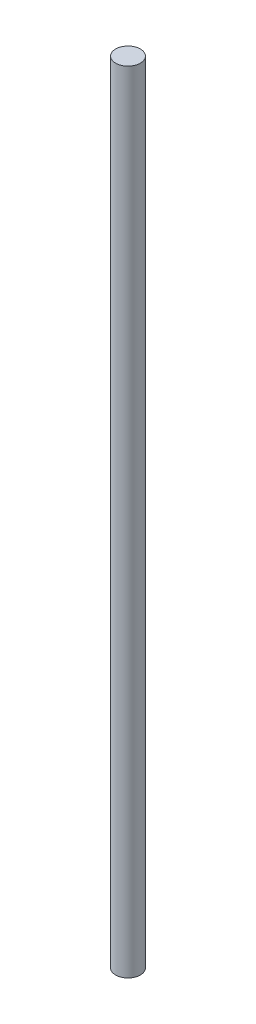
ISO-10303-21;
HEADER;
FILE_DESCRIPTION(('STEP AP214'),'2;1');
FILE_NAME('part.step','',(''),(''),'','','');
FILE_SCHEMA(('AUTOMOTIVE_DESIGN { 1 0 10303 214 1 1 1 1 }'));
ENDSEC;
DATA;
#1=APPLICATION_CONTEXT('core data for automotive mechanical design processes');
#2=APPLICATION_PROTOCOL_DEFINITION('international standard','automotive_design',2000,#1);
#3=PRODUCT_CONTEXT('',#1,'mechanical');
#4=PRODUCT('Part','Part','',(#3));
#5=PRODUCT_RELATED_PRODUCT_CATEGORY('part','',(#4));
#6=PRODUCT_DEFINITION_FORMATION('','',#4);
#7=PRODUCT_DEFINITION_CONTEXT('part definition',#1,'design');
#8=PRODUCT_DEFINITION('design','',#6,#7);
#9=PRODUCT_DEFINITION_SHAPE('','',#8);
#10=(LENGTH_UNIT() NAMED_UNIT(*) SI_UNIT(.MILLI.,.METRE.));
#11=(NAMED_UNIT(*) PLANE_ANGLE_UNIT() SI_UNIT($,.RADIAN.));
#12=(NAMED_UNIT(*) SI_UNIT($,.STERADIAN.) SOLID_ANGLE_UNIT());
#13=UNCERTAINTY_MEASURE_WITH_UNIT(LENGTH_MEASURE(1.E-05),#10,'distance_accuracy_value','');
#14=(GEOMETRIC_REPRESENTATION_CONTEXT(3) GLOBAL_UNCERTAINTY_ASSIGNED_CONTEXT((#13)) GLOBAL_UNIT_ASSIGNED_CONTEXT((#10,
#11,#12)) REPRESENTATION_CONTEXT('',''));
#15=CARTESIAN_POINT('',(0.,0.,0.));
#16=DIRECTION('',(0.,0.,1.));
#17=DIRECTION('',(1.,0.,0.));
#18=AXIS2_PLACEMENT_3D('',#15,#16,#17);
#19=CARTESIAN_POINT('',(0.,254.,0.));
#20=DIRECTION('',(0.,-1.,0.));
#21=DIRECTION('',(0.,0.,-1.));
#22=AXIS2_PLACEMENT_3D('',#19,#20,#21);
#23=CYLINDRICAL_SURFACE('',#22,3.96875);
#24=CARTESIAN_POINT('',(0.,254.,0.));
#25=DIRECTION('',(0.,1.,0.));
#26=DIRECTION('',(0.,0.,1.));
#27=AXIS2_PLACEMENT_3D('',#24,#25,#26);
#28=CIRCLE('',#27,3.96875);
#29=CARTESIAN_POINT('',(0.,254.,3.96875));
#30=VERTEX_POINT('',#29);
#31=EDGE_CURVE('E10',#30,#30,#28,.T.);
#32=ORIENTED_EDGE('',*,*,#31,.F.);
#33=EDGE_LOOP('',(#32));
#34=FACE_BOUND('',#33,.T.);
#35=CARTESIAN_POINT('',(0.,0.,0.));
#36=DIRECTION('',(0.,1.,0.));
#37=DIRECTION('',(0.,0.,1.));
#38=AXIS2_PLACEMENT_3D('',#35,#36,#37);
#39=CIRCLE('',#38,3.96875);
#40=CARTESIAN_POINT('',(0.,0.,3.96875));
#41=VERTEX_POINT('',#40);
#42=EDGE_CURVE('E34',#41,#41,#39,.T.);
#43=ORIENTED_EDGE('',*,*,#42,.T.);
#44=EDGE_LOOP('',(#43));
#45=FACE_BOUND('',#44,.T.);
#46=ADVANCED_FACE('F31',(#34,#45),#23,.T.);
#47=CARTESIAN_POINT('',(0.,254.,0.));
#48=DIRECTION('',(0.,1.,0.));
#49=DIRECTION('',(0.,0.,1.));
#50=AXIS2_PLACEMENT_3D('',#47,#48,#49);
#51=PLANE('',#50);
#52=ORIENTED_EDGE('',*,*,#31,.T.);
#53=EDGE_LOOP('',(#52));
#54=FACE_BOUND('',#53,.T.);
#55=ADVANCED_FACE('F46',(#54),#51,.T.);
#56=CARTESIAN_POINT('',(0.,0.,0.));
#57=DIRECTION('',(0.,1.,0.));
#58=DIRECTION('',(0.,0.,1.));
#59=AXIS2_PLACEMENT_3D('',#56,#57,#58);
#60=PLANE('',#59);
#61=ORIENTED_EDGE('',*,*,#42,.F.);
#62=EDGE_LOOP('',(#61));
#63=FACE_BOUND('',#62,.T.);
#64=ADVANCED_FACE('F44',(#63),#60,.F.);
#65=CLOSED_SHELL('',(#46,#55,#64));
#66=MANIFOLD_SOLID_BREP('B2',#65);
#67=ADVANCED_BREP_SHAPE_REPRESENTATION('',(#18,#66),#14);
#68=SHAPE_DEFINITION_REPRESENTATION(#9,#67);
ENDSEC;
END-ISO-10303-21;
